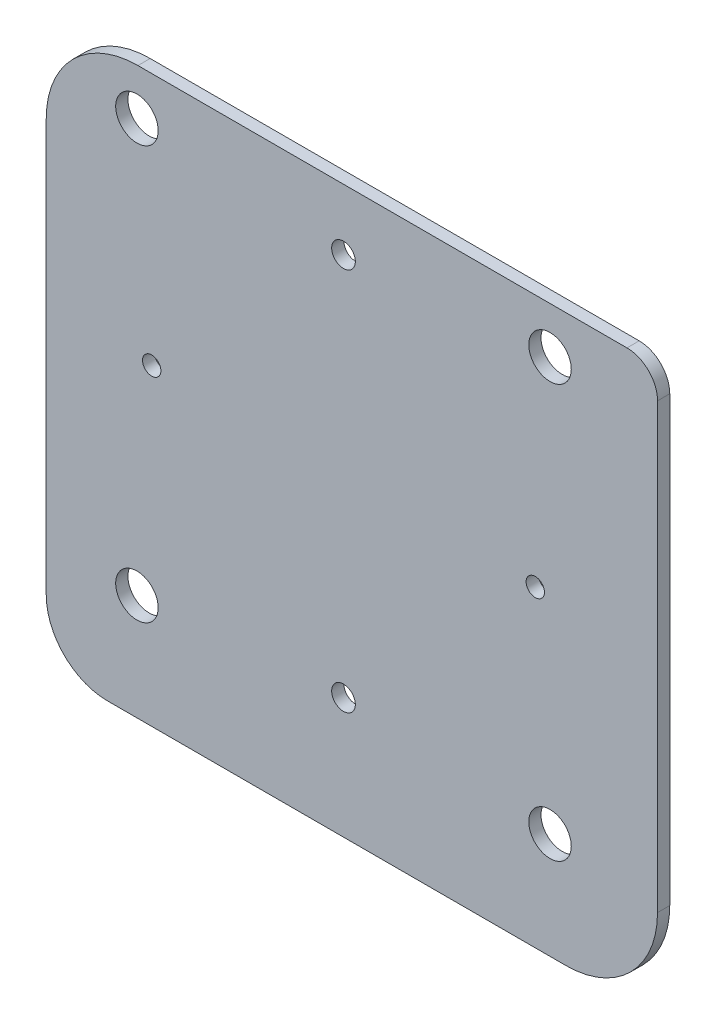
ISO-10303-21;
HEADER;
FILE_DESCRIPTION(('STEP AP214'),'2;1');
FILE_NAME('part.step','',(''),(''),'','','');
FILE_SCHEMA(('AUTOMOTIVE_DESIGN { 1 0 10303 214 1 1 1 1 }'));
ENDSEC;
DATA;
#1=APPLICATION_CONTEXT('core data for automotive mechanical design processes');
#2=APPLICATION_PROTOCOL_DEFINITION('international standard','automotive_design',2000,#1);
#3=PRODUCT_CONTEXT('',#1,'mechanical');
#4=PRODUCT('Part','Part','',(#3));
#5=PRODUCT_RELATED_PRODUCT_CATEGORY('part','',(#4));
#6=PRODUCT_DEFINITION_FORMATION('','',#4);
#7=PRODUCT_DEFINITION_CONTEXT('part definition',#1,'design');
#8=PRODUCT_DEFINITION('design','',#6,#7);
#9=PRODUCT_DEFINITION_SHAPE('','',#8);
#10=(LENGTH_UNIT() NAMED_UNIT(*) SI_UNIT(.MILLI.,.METRE.));
#11=(NAMED_UNIT(*) PLANE_ANGLE_UNIT() SI_UNIT($,.RADIAN.));
#12=(NAMED_UNIT(*) SI_UNIT($,.STERADIAN.) SOLID_ANGLE_UNIT());
#13=UNCERTAINTY_MEASURE_WITH_UNIT(LENGTH_MEASURE(1.E-05),#10,'distance_accuracy_value','');
#14=(GEOMETRIC_REPRESENTATION_CONTEXT(3) GLOBAL_UNCERTAINTY_ASSIGNED_CONTEXT((#13)) GLOBAL_UNIT_ASSIGNED_CONTEXT((#10,
#11,#12)) REPRESENTATION_CONTEXT('',''));
#15=CARTESIAN_POINT('',(0.,0.,0.));
#16=DIRECTION('',(0.,0.,1.));
#17=DIRECTION('',(1.,0.,0.));
#18=AXIS2_PLACEMENT_3D('',#15,#16,#17);
#19=CARTESIAN_POINT('',(-26.9000000000002,21.1,1.6));
#20=DIRECTION('',(0.,0.,-1.));
#21=DIRECTION('',(-1.,0.,0.));
#22=AXIS2_PLACEMENT_3D('',#19,#20,#21);
#23=CYLINDRICAL_SURFACE('',#22,12.);
#24=CARTESIAN_POINT('',(-26.9000000000002,21.1,0.));
#25=DIRECTION('',(0.,0.,1.));
#26=DIRECTION('',(-1.,0.,0.));
#27=AXIS2_PLACEMENT_3D('',#24,#25,#26);
#28=CIRCLE('',#27,12.);
#29=CARTESIAN_POINT('',(-26.9000000000002,33.1,0.));
#30=VERTEX_POINT('',#29);
#31=CARTESIAN_POINT('',(-38.9000000000002,21.0999999999999,0.));
#32=VERTEX_POINT('',#31);
#33=EDGE_CURVE('E130',#30,#32,#28,.T.);
#34=ORIENTED_EDGE('',*,*,#33,.T.);
#35=DIRECTION('',(0.,0.,-1.));
#36=VECTOR('',#35,1.);
#37=CARTESIAN_POINT('',(-38.9000000000002,21.0999999999999,1.6));
#38=LINE('',#37,#36);
#39=CARTESIAN_POINT('',(-38.9000000000002,21.0999999999999,1.6));
#40=VERTEX_POINT('',#39);
#41=EDGE_CURVE('E11',#40,#32,#38,.T.);
#42=ORIENTED_EDGE('',*,*,#41,.F.);
#43=CARTESIAN_POINT('',(-26.9000000000002,21.1,1.6));
#44=DIRECTION('',(0.,0.,1.));
#45=DIRECTION('',(-1.,0.,0.));
#46=AXIS2_PLACEMENT_3D('',#43,#44,#45);
#47=CIRCLE('',#46,12.);
#48=CARTESIAN_POINT('',(-26.9000000000002,33.1,1.6));
#49=VERTEX_POINT('',#48);
#50=EDGE_CURVE('E145',#49,#40,#47,.T.);
#51=ORIENTED_EDGE('',*,*,#50,.F.);
#52=DIRECTION('',(0.,0.,-1.));
#53=VECTOR('',#52,1.);
#54=CARTESIAN_POINT('',(-26.9000000000002,33.1,1.6));
#55=LINE('',#54,#53);
#56=EDGE_CURVE('E126',#49,#30,#55,.T.);
#57=ORIENTED_EDGE('',*,*,#56,.T.);
#58=EDGE_LOOP('',(#34,#42,#51,#57));
#59=FACE_BOUND('',#58,.T.);
#60=ADVANCED_FACE('F34',(#59),#23,.T.);
#61=CARTESIAN_POINT('',(-38.9000000000002,21.0999999999999,1.6));
#62=DIRECTION('',(1.,0.,0.));
#63=DIRECTION('',(0.,1.,0.));
#64=AXIS2_PLACEMENT_3D('',#61,#62,#63);
#65=PLANE('',#64);
#66=DIRECTION('',(0.,-1.,0.));
#67=VECTOR('',#66,1.);
#68=CARTESIAN_POINT('',(-38.9000000000002,21.0999999999999,0.));
#69=LINE('',#68,#67);
#70=CARTESIAN_POINT('',(-38.8999999999997,-32.9000000000001,0.));
#71=VERTEX_POINT('',#70);
#72=EDGE_CURVE('E133',#32,#71,#69,.T.);
#73=ORIENTED_EDGE('',*,*,#72,.T.);
#74=DIRECTION('',(0.,0.,-1.));
#75=VECTOR('',#74,1.);
#76=CARTESIAN_POINT('',(-38.8999999999997,-32.9000000000001,1.6));
#77=LINE('',#76,#75);
#78=CARTESIAN_POINT('',(-38.8999999999997,-32.9000000000001,1.6));
#79=VERTEX_POINT('',#78);
#80=EDGE_CURVE('E42',#79,#71,#77,.T.);
#81=ORIENTED_EDGE('',*,*,#80,.F.);
#82=DIRECTION('',(0.,-1.,0.));
#83=VECTOR('',#82,1.);
#84=CARTESIAN_POINT('',(-38.9000000000002,21.0999999999999,1.6));
#85=LINE('',#84,#83);
#86=EDGE_CURVE('E93',#40,#79,#85,.T.);
#87=ORIENTED_EDGE('',*,*,#86,.F.);
#88=ORIENTED_EDGE('',*,*,#41,.T.);
#89=EDGE_LOOP('',(#73,#81,#87,#88));
#90=FACE_BOUND('',#89,.T.);
#91=ADVANCED_FACE('F259',(#90),#65,.F.);
#92=CARTESIAN_POINT('',(-30.8999999999997,-32.9,1.6));
#93=DIRECTION('',(0.,0.,-1.));
#94=DIRECTION('',(-1.,0.,0.));
#95=AXIS2_PLACEMENT_3D('',#92,#93,#94);
#96=CYLINDRICAL_SURFACE('',#95,8.);
#97=CARTESIAN_POINT('',(-30.8999999999997,-32.9,0.));
#98=DIRECTION('',(0.,0.,1.));
#99=DIRECTION('',(1.,0.,0.));
#100=AXIS2_PLACEMENT_3D('',#97,#98,#99);
#101=CIRCLE('',#100,8.);
#102=CARTESIAN_POINT('',(-30.8999999999997,-40.9,0.));
#103=VERTEX_POINT('',#102);
#104=EDGE_CURVE('E136',#71,#103,#101,.T.);
#105=ORIENTED_EDGE('',*,*,#104,.T.);
#106=DIRECTION('',(0.,0.,-1.));
#107=VECTOR('',#106,1.);
#108=CARTESIAN_POINT('',(-30.8999999999997,-40.9,1.6));
#109=LINE('',#108,#107);
#110=CARTESIAN_POINT('',(-30.8999999999997,-40.9,1.6));
#111=VERTEX_POINT('',#110);
#112=EDGE_CURVE('E152',#111,#103,#109,.T.);
#113=ORIENTED_EDGE('',*,*,#112,.F.);
#114=CARTESIAN_POINT('',(-30.8999999999997,-32.9,1.6));
#115=DIRECTION('',(0.,0.,1.));
#116=DIRECTION('',(1.,0.,0.));
#117=AXIS2_PLACEMENT_3D('',#114,#115,#116);
#118=CIRCLE('',#117,8.);
#119=EDGE_CURVE('E160',#79,#111,#118,.T.);
#120=ORIENTED_EDGE('',*,*,#119,.F.);
#121=ORIENTED_EDGE('',*,*,#80,.T.);
#122=EDGE_LOOP('',(#105,#113,#120,#121));
#123=FACE_BOUND('',#122,.T.);
#124=ADVANCED_FACE('F158',(#123),#96,.T.);
#125=CARTESIAN_POINT('',(-30.8999999999997,-40.9,1.6));
#126=DIRECTION('',(0.,1.,0.));
#127=DIRECTION('',(-1.,0.,0.));
#128=AXIS2_PLACEMENT_3D('',#125,#126,#127);
#129=PLANE('',#128);
#130=DIRECTION('',(1.,0.,0.));
#131=VECTOR('',#130,1.);
#132=CARTESIAN_POINT('',(-30.8999999999997,-40.9,0.));
#133=LINE('',#132,#131);
#134=CARTESIAN_POINT('',(29.1000000000003,-40.9,0.));
#135=VERTEX_POINT('',#134);
#136=EDGE_CURVE('E138',#103,#135,#133,.T.);
#137=ORIENTED_EDGE('',*,*,#136,.T.);
#138=DIRECTION('',(0.,0.,-1.));
#139=VECTOR('',#138,1.);
#140=CARTESIAN_POINT('',(29.1000000000003,-40.9,1.6));
#141=LINE('',#140,#139);
#142=CARTESIAN_POINT('',(29.1000000000003,-40.9,1.6));
#143=VERTEX_POINT('',#142);
#144=EDGE_CURVE('E149',#143,#135,#141,.T.);
#145=ORIENTED_EDGE('',*,*,#144,.F.);
#146=DIRECTION('',(1.,0.,0.));
#147=VECTOR('',#146,1.);
#148=CARTESIAN_POINT('',(-30.8999999999997,-40.9,1.6));
#149=LINE('',#148,#147);
#150=EDGE_CURVE('E172',#111,#143,#149,.T.);
#151=ORIENTED_EDGE('',*,*,#150,.F.);
#152=ORIENTED_EDGE('',*,*,#112,.T.);
#153=EDGE_LOOP('',(#137,#145,#151,#152));
#154=FACE_BOUND('',#153,.T.);
#155=ADVANCED_FACE('F168',(#154),#129,.F.);
#156=CARTESIAN_POINT('',(29.1000000000003,-28.9,1.6));
#157=DIRECTION('',(0.,0.,-1.));
#158=DIRECTION('',(-1.,0.,0.));
#159=AXIS2_PLACEMENT_3D('',#156,#157,#158);
#160=CYLINDRICAL_SURFACE('',#159,12.);
#161=CARTESIAN_POINT('',(29.1000000000003,-28.9,0.));
#162=DIRECTION('',(0.,0.,1.));
#163=DIRECTION('',(-1.,0.,0.));
#164=AXIS2_PLACEMENT_3D('',#161,#162,#163);
#165=CIRCLE('',#164,12.);
#166=CARTESIAN_POINT('',(41.1000000000003,-28.9,0.));
#167=VERTEX_POINT('',#166);
#168=EDGE_CURVE('E140',#135,#167,#165,.T.);
#169=ORIENTED_EDGE('',*,*,#168,.T.);
#170=DIRECTION('',(0.,0.,-1.));
#171=VECTOR('',#170,1.);
#172=CARTESIAN_POINT('',(41.1000000000003,-28.9,1.6));
#173=LINE('',#172,#171);
#174=CARTESIAN_POINT('',(41.1000000000003,-28.9,1.6));
#175=VERTEX_POINT('',#174);
#176=EDGE_CURVE('E121',#175,#167,#173,.T.);
#177=ORIENTED_EDGE('',*,*,#176,.F.);
#178=CARTESIAN_POINT('',(29.1000000000003,-28.9,1.6));
#179=DIRECTION('',(0.,0.,1.));
#180=DIRECTION('',(-1.,0.,0.));
#181=AXIS2_PLACEMENT_3D('',#178,#179,#180);
#182=CIRCLE('',#181,12.);
#183=EDGE_CURVE('E112',#143,#175,#182,.T.);
#184=ORIENTED_EDGE('',*,*,#183,.F.);
#185=ORIENTED_EDGE('',*,*,#144,.T.);
#186=EDGE_LOOP('',(#169,#177,#184,#185));
#187=FACE_BOUND('',#186,.T.);
#188=ADVANCED_FACE('F171',(#187),#160,.T.);
#189=CARTESIAN_POINT('',(41.1000000000003,-28.9,1.6));
#190=DIRECTION('',(-1.,0.,0.));
#191=DIRECTION('',(0.,0.,1.));
#192=AXIS2_PLACEMENT_3D('',#189,#190,#191);
#193=PLANE('',#192);
#194=DIRECTION('',(0.,1.,0.));
#195=VECTOR('',#194,1.);
#196=CARTESIAN_POINT('',(41.1000000000003,-28.9,0.));
#197=LINE('',#196,#195);
#198=CARTESIAN_POINT('',(41.1000000000003,29.1000000000001,0.));
#199=VERTEX_POINT('',#198);
#200=EDGE_CURVE('E120',#167,#199,#197,.T.);
#201=ORIENTED_EDGE('',*,*,#200,.T.);
#202=DIRECTION('',(0.,0.,-1.));
#203=VECTOR('',#202,1.);
#204=CARTESIAN_POINT('',(41.1000000000003,29.1000000000001,1.6));
#205=LINE('',#204,#203);
#206=CARTESIAN_POINT('',(41.1000000000003,29.1000000000001,1.6));
#207=VERTEX_POINT('',#206);
#208=EDGE_CURVE('E117',#207,#199,#205,.T.);
#209=ORIENTED_EDGE('',*,*,#208,.F.);
#210=DIRECTION('',(0.,1.,0.));
#211=VECTOR('',#210,1.);
#212=CARTESIAN_POINT('',(41.1000000000003,-28.9,1.6));
#213=LINE('',#212,#211);
#214=EDGE_CURVE('E106',#175,#207,#213,.T.);
#215=ORIENTED_EDGE('',*,*,#214,.F.);
#216=ORIENTED_EDGE('',*,*,#176,.T.);
#217=EDGE_LOOP('',(#201,#209,#215,#216));
#218=FACE_BOUND('',#217,.T.);
#219=ADVANCED_FACE('F118',(#218),#193,.F.);
#220=CARTESIAN_POINT('',(37.1000000000003,29.1,1.6));
#221=DIRECTION('',(0.,0.,-1.));
#222=DIRECTION('',(-1.,0.,0.));
#223=AXIS2_PLACEMENT_3D('',#220,#221,#222);
#224=CYLINDRICAL_SURFACE('',#223,4.);
#225=CARTESIAN_POINT('',(37.1000000000003,29.1,0.));
#226=DIRECTION('',(0.,0.,1.));
#227=DIRECTION('',(1.,0.,0.));
#228=AXIS2_PLACEMENT_3D('',#225,#226,#227);
#229=CIRCLE('',#228,4.);
#230=CARTESIAN_POINT('',(37.0999999999998,33.1,0.));
#231=VERTEX_POINT('',#230);
#232=EDGE_CURVE('E79',#199,#231,#229,.T.);
#233=ORIENTED_EDGE('',*,*,#232,.T.);
#234=DIRECTION('',(0.,0.,-1.));
#235=VECTOR('',#234,1.);
#236=CARTESIAN_POINT('',(37.0999999999998,33.1,1.6));
#237=LINE('',#236,#235);
#238=CARTESIAN_POINT('',(37.0999999999998,33.1,1.6));
#239=VERTEX_POINT('',#238);
#240=EDGE_CURVE('E122',#239,#231,#237,.T.);
#241=ORIENTED_EDGE('',*,*,#240,.F.);
#242=CARTESIAN_POINT('',(37.1000000000003,29.1,1.6));
#243=DIRECTION('',(0.,0.,1.));
#244=DIRECTION('',(1.,0.,0.));
#245=AXIS2_PLACEMENT_3D('',#242,#243,#244);
#246=CIRCLE('',#245,4.);
#247=EDGE_CURVE('E110',#207,#239,#246,.T.);
#248=ORIENTED_EDGE('',*,*,#247,.F.);
#249=ORIENTED_EDGE('',*,*,#208,.T.);
#250=EDGE_LOOP('',(#233,#241,#248,#249));
#251=FACE_BOUND('',#250,.T.);
#252=ADVANCED_FACE('F124',(#251),#224,.T.);
#253=CARTESIAN_POINT('',(-26.9000000000002,33.1,1.6));
#254=DIRECTION('',(0.,-1.,0.));
#255=DIRECTION('',(1.,0.,0.));
#256=AXIS2_PLACEMENT_3D('',#253,#254,#255);
#257=PLANE('',#256);
#258=DIRECTION('',(-1.,0.,0.));
#259=VECTOR('',#258,1.);
#260=CARTESIAN_POINT('',(-26.9000000000002,33.1,0.));
#261=LINE('',#260,#259);
#262=EDGE_CURVE('E85',#231,#30,#261,.T.);
#263=ORIENTED_EDGE('',*,*,#262,.T.);
#264=ORIENTED_EDGE('',*,*,#56,.F.);
#265=DIRECTION('',(-1.,0.,0.));
#266=VECTOR('',#265,1.);
#267=CARTESIAN_POINT('',(-26.9000000000002,33.1,1.6));
#268=LINE('',#267,#266);
#269=EDGE_CURVE('E50',#239,#49,#268,.T.);
#270=ORIENTED_EDGE('',*,*,#269,.F.);
#271=ORIENTED_EDGE('',*,*,#240,.T.);
#272=EDGE_LOOP('',(#263,#264,#270,#271));
#273=FACE_BOUND('',#272,.T.);
#274=ADVANCED_FACE('F230',(#273),#257,.F.);
#275=CARTESIAN_POINT('',(-26.9000000000002,21.1,1.6));
#276=DIRECTION('',(0.,0.,-1.));
#277=DIRECTION('',(-1.,0.,0.));
#278=AXIS2_PLACEMENT_3D('',#275,#276,#277);
#279=PLANE('',#278);
#280=CARTESIAN_POINT('',(27.0307333360464,27.0307333360452,1.6));
#281=DIRECTION('',(0.,0.,1.));
#282=DIRECTION('',(1.,0.,0.));
#283=AXIS2_PLACEMENT_3D('',#280,#281,#282);
#284=CIRCLE('',#283,2.78);
#285=CARTESIAN_POINT('',(29.8107333360464,27.0307333360452,1.6));
#286=VERTEX_POINT('',#285);
#287=EDGE_CURVE('E205',#286,#286,#284,.T.);
#288=ORIENTED_EDGE('',*,*,#287,.F.);
#289=EDGE_LOOP('',(#288));
#290=FACE_BOUND('',#289,.T.);
#291=CARTESIAN_POINT('',(-27.0307333360462,-27.0307333360454,1.6));
#292=DIRECTION('',(0.,0.,1.));
#293=DIRECTION('',(1.,0.,0.));
#294=AXIS2_PLACEMENT_3D('',#291,#292,#293);
#295=CIRCLE('',#294,2.78);
#296=CARTESIAN_POINT('',(-24.2507333360462,-27.0307333360454,1.6));
#297=VERTEX_POINT('',#296);
#298=EDGE_CURVE('E211',#297,#297,#295,.T.);
#299=ORIENTED_EDGE('',*,*,#298,.F.);
#300=EDGE_LOOP('',(#299));
#301=FACE_BOUND('',#300,.T.);
#302=CARTESIAN_POINT('',(27.0307333360455,-27.0307333360461,1.6));
#303=DIRECTION('',(0.,0.,1.));
#304=DIRECTION('',(1.,0.,0.));
#305=AXIS2_PLACEMENT_3D('',#302,#303,#304);
#306=CIRCLE('',#305,2.78);
#307=CARTESIAN_POINT('',(29.8107333360455,-27.0307333360461,1.6));
#308=VERTEX_POINT('',#307);
#309=EDGE_CURVE('E212',#308,#308,#306,.T.);
#310=ORIENTED_EDGE('',*,*,#309,.F.);
#311=EDGE_LOOP('',(#310));
#312=FACE_BOUND('',#311,.T.);
#313=CARTESIAN_POINT('',(-27.0307333360453,27.0307333360463,1.6));
#314=DIRECTION('',(0.,0.,1.));
#315=DIRECTION('',(1.,0.,0.));
#316=AXIS2_PLACEMENT_3D('',#313,#314,#315);
#317=CIRCLE('',#316,2.78);
#318=CARTESIAN_POINT('',(-24.2507333360453,27.0307333360463,1.6));
#319=VERTEX_POINT('',#318);
#320=EDGE_CURVE('E182',#319,#319,#317,.T.);
#321=ORIENTED_EDGE('',*,*,#320,.F.);
#322=EDGE_LOOP('',(#321));
#323=FACE_BOUND('',#322,.T.);
#324=CARTESIAN_POINT('',(-6.67661181896761E-06,25.0999914458268,1.6));
#325=DIRECTION('',(0.,0.,1.));
#326=DIRECTION('',(1.,0.,0.));
#327=AXIS2_PLACEMENT_3D('',#324,#325,#326);
#328=CIRCLE('',#327,1.55);
#329=CARTESIAN_POINT('',(1.54999332338818,25.0999914458268,1.6));
#330=VERTEX_POINT('',#329);
#331=EDGE_CURVE('E134',#330,#330,#328,.T.);
#332=ORIENTED_EDGE('',*,*,#331,.F.);
#333=EDGE_LOOP('',(#332));
#334=FACE_BOUND('',#333,.T.);
#335=CARTESIAN_POINT('',(25.0999933233883,-8.55417322392915E-06,1.6));
#336=DIRECTION('',(0.,0.,1.));
#337=DIRECTION('',(1.,0.,0.));
#338=AXIS2_PLACEMENT_3D('',#335,#336,#337);
#339=CIRCLE('',#338,1.19999999999999);
#340=CARTESIAN_POINT('',(26.2999933233883,-8.55417322392915E-06,1.6));
#341=VERTEX_POINT('',#340);
#342=EDGE_CURVE('E194',#341,#341,#339,.T.);
#343=ORIENTED_EDGE('',*,*,#342,.F.);
#344=EDGE_LOOP('',(#343));
#345=FACE_BOUND('',#344,.T.);
#346=CARTESIAN_POINT('',(-6.67661187447877E-06,-25.1000085541733,1.6));
#347=DIRECTION('',(0.,0.,1.));
#348=DIRECTION('',(1.,0.,0.));
#349=AXIS2_PLACEMENT_3D('',#346,#347,#348);
#350=CIRCLE('',#349,1.55);
#351=CARTESIAN_POINT('',(1.54999332338812,-25.1000085541733,1.6));
#352=VERTEX_POINT('',#351);
#353=EDGE_CURVE('E188',#352,#352,#350,.T.);
#354=ORIENTED_EDGE('',*,*,#353,.F.);
#355=EDGE_LOOP('',(#354));
#356=FACE_BOUND('',#355,.T.);
#357=CARTESIAN_POINT('',(-25.1000066766119,-8.55417322392915E-06,1.6));
#358=DIRECTION('',(0.,0.,1.));
#359=DIRECTION('',(1.,0.,0.));
#360=AXIS2_PLACEMENT_3D('',#357,#358,#359);
#361=CIRCLE('',#360,1.2);
#362=CARTESIAN_POINT('',(-23.9000066766119,-8.55417322392915E-06,1.6));
#363=VERTEX_POINT('',#362);
#364=EDGE_CURVE('E181',#363,#363,#361,.T.);
#365=ORIENTED_EDGE('',*,*,#364,.F.);
#366=EDGE_LOOP('',(#365));
#367=FACE_BOUND('',#366,.T.);
#368=ORIENTED_EDGE('',*,*,#50,.T.);
#369=ORIENTED_EDGE('',*,*,#86,.T.);
#370=ORIENTED_EDGE('',*,*,#119,.T.);
#371=ORIENTED_EDGE('',*,*,#150,.T.);
#372=ORIENTED_EDGE('',*,*,#183,.T.);
#373=ORIENTED_EDGE('',*,*,#214,.T.);
#374=ORIENTED_EDGE('',*,*,#247,.T.);
#375=ORIENTED_EDGE('',*,*,#269,.T.);
#376=EDGE_LOOP('',(#368,#369,#370,#371,#372,#373,#374,#375));
#377=FACE_BOUND('',#376,.T.);
#378=ADVANCED_FACE('F108',(#290,#301,#312,#323,#334,#345,#356,#367,#377),#279,.F.);
#379=CARTESIAN_POINT('',(-26.9000000000002,21.1,0.));
#380=DIRECTION('',(0.,0.,-1.));
#381=DIRECTION('',(-1.,0.,0.));
#382=AXIS2_PLACEMENT_3D('',#379,#380,#381);
#383=PLANE('',#382);
#384=CARTESIAN_POINT('',(27.0307333360464,27.0307333360452,0.));
#385=DIRECTION('',(0.,0.,-1.));
#386=DIRECTION('',(-1.,0.,0.));
#387=AXIS2_PLACEMENT_3D('',#384,#385,#386);
#388=CIRCLE('',#387,2.78);
#389=CARTESIAN_POINT('',(24.2507333360464,27.0307333360452,0.));
#390=VERTEX_POINT('',#389);
#391=EDGE_CURVE('E215',#390,#390,#388,.F.);
#392=ORIENTED_EDGE('',*,*,#391,.T.);
#393=EDGE_LOOP('',(#392));
#394=FACE_BOUND('',#393,.T.);
#395=CARTESIAN_POINT('',(-27.0307333360462,-27.0307333360454,0.));
#396=DIRECTION('',(0.,0.,-1.));
#397=DIRECTION('',(-1.,0.,0.));
#398=AXIS2_PLACEMENT_3D('',#395,#396,#397);
#399=CIRCLE('',#398,2.78);
#400=CARTESIAN_POINT('',(-29.8107333360462,-27.0307333360454,0.));
#401=VERTEX_POINT('',#400);
#402=EDGE_CURVE('E208',#401,#401,#399,.F.);
#403=ORIENTED_EDGE('',*,*,#402,.T.);
#404=EDGE_LOOP('',(#403));
#405=FACE_BOUND('',#404,.T.);
#406=CARTESIAN_POINT('',(27.0307333360455,-27.0307333360461,0.));
#407=DIRECTION('',(0.,0.,-1.));
#408=DIRECTION('',(-1.,0.,0.));
#409=AXIS2_PLACEMENT_3D('',#406,#407,#408);
#410=CIRCLE('',#409,2.78);
#411=CARTESIAN_POINT('',(24.2507333360455,-27.0307333360461,0.));
#412=VERTEX_POINT('',#411);
#413=EDGE_CURVE('E220',#412,#412,#410,.F.);
#414=ORIENTED_EDGE('',*,*,#413,.T.);
#415=EDGE_LOOP('',(#414));
#416=FACE_BOUND('',#415,.T.);
#417=CARTESIAN_POINT('',(-27.0307333360453,27.0307333360463,0.));
#418=DIRECTION('',(0.,0.,-1.));
#419=DIRECTION('',(-1.,0.,0.));
#420=AXIS2_PLACEMENT_3D('',#417,#418,#419);
#421=CIRCLE('',#420,2.78);
#422=CARTESIAN_POINT('',(-29.8107333360453,27.0307333360463,0.));
#423=VERTEX_POINT('',#422);
#424=EDGE_CURVE('E202',#423,#423,#421,.F.);
#425=ORIENTED_EDGE('',*,*,#424,.T.);
#426=EDGE_LOOP('',(#425));
#427=FACE_BOUND('',#426,.T.);
#428=CARTESIAN_POINT('',(-6.67661181896761E-06,25.0999914458268,0.));
#429=DIRECTION('',(0.,0.,-1.));
#430=DIRECTION('',(-1.,0.,0.));
#431=AXIS2_PLACEMENT_3D('',#428,#429,#430);
#432=CIRCLE('',#431,1.55);
#433=CARTESIAN_POINT('',(-1.55000667661182,25.0999914458268,0.));
#434=VERTEX_POINT('',#433);
#435=EDGE_CURVE('E197',#434,#434,#432,.F.);
#436=ORIENTED_EDGE('',*,*,#435,.T.);
#437=EDGE_LOOP('',(#436));
#438=FACE_BOUND('',#437,.T.);
#439=CARTESIAN_POINT('',(25.0999933233883,-8.55417322392915E-06,0.));
#440=DIRECTION('',(0.,0.,-1.));
#441=DIRECTION('',(-1.,0.,0.));
#442=AXIS2_PLACEMENT_3D('',#439,#440,#441);
#443=CIRCLE('',#442,1.19999999999999);
#444=CARTESIAN_POINT('',(23.8999933233883,-8.55417322392915E-06,0.));
#445=VERTEX_POINT('',#444);
#446=EDGE_CURVE('E191',#445,#445,#443,.F.);
#447=ORIENTED_EDGE('',*,*,#446,.T.);
#448=EDGE_LOOP('',(#447));
#449=FACE_BOUND('',#448,.T.);
#450=CARTESIAN_POINT('',(-6.67661187447877E-06,-25.1000085541733,0.));
#451=DIRECTION('',(0.,0.,-1.));
#452=DIRECTION('',(-1.,0.,0.));
#453=AXIS2_PLACEMENT_3D('',#450,#451,#452);
#454=CIRCLE('',#453,1.55);
#455=CARTESIAN_POINT('',(-1.55000667661187,-25.1000085541733,0.));
#456=VERTEX_POINT('',#455);
#457=EDGE_CURVE('E185',#456,#456,#454,.F.);
#458=ORIENTED_EDGE('',*,*,#457,.T.);
#459=EDGE_LOOP('',(#458));
#460=FACE_BOUND('',#459,.T.);
#461=CARTESIAN_POINT('',(-25.1000066766119,-8.55417322392915E-06,0.));
#462=DIRECTION('',(0.,0.,-1.));
#463=DIRECTION('',(-1.,0.,0.));
#464=AXIS2_PLACEMENT_3D('',#461,#462,#463);
#465=CIRCLE('',#464,1.2);
#466=CARTESIAN_POINT('',(-26.3000066766119,-8.55417322392915E-06,0.));
#467=VERTEX_POINT('',#466);
#468=EDGE_CURVE('E178',#467,#467,#465,.F.);
#469=ORIENTED_EDGE('',*,*,#468,.T.);
#470=EDGE_LOOP('',(#469));
#471=FACE_BOUND('',#470,.T.);
#472=ORIENTED_EDGE('',*,*,#33,.F.);
#473=ORIENTED_EDGE('',*,*,#262,.F.);
#474=ORIENTED_EDGE('',*,*,#232,.F.);
#475=ORIENTED_EDGE('',*,*,#200,.F.);
#476=ORIENTED_EDGE('',*,*,#168,.F.);
#477=ORIENTED_EDGE('',*,*,#136,.F.);
#478=ORIENTED_EDGE('',*,*,#104,.F.);
#479=ORIENTED_EDGE('',*,*,#72,.F.);
#480=EDGE_LOOP('',(#472,#473,#474,#475,#476,#477,#478,#479));
#481=FACE_BOUND('',#480,.T.);
#482=ADVANCED_FACE('F164',(#394,#405,#416,#427,#438,#449,#460,#471,#481),#383,.T.);
#483=CARTESIAN_POINT('',(-25.1000066766119,-8.55417322392915E-06,-0.000999999999999916));
#484=DIRECTION('',(0.,0.,1.));
#485=DIRECTION('',(1.,0.,0.));
#486=AXIS2_PLACEMENT_3D('',#483,#484,#485);
#487=CYLINDRICAL_SURFACE('',#486,1.2);
#488=ORIENTED_EDGE('',*,*,#468,.F.);
#489=EDGE_LOOP('',(#488));
#490=FACE_BOUND('',#489,.T.);
#491=ORIENTED_EDGE('',*,*,#364,.T.);
#492=EDGE_LOOP('',(#491));
#493=FACE_BOUND('',#492,.T.);
#494=ADVANCED_FACE('F243',(#490,#493),#487,.F.);
#495=CARTESIAN_POINT('',(-6.67661187447877E-06,-25.1000085541733,-0.000999999999999916));
#496=DIRECTION('',(0.,0.,1.));
#497=DIRECTION('',(1.,0.,0.));
#498=AXIS2_PLACEMENT_3D('',#495,#496,#497);
#499=CYLINDRICAL_SURFACE('',#498,1.55);
#500=ORIENTED_EDGE('',*,*,#457,.F.);
#501=EDGE_LOOP('',(#500));
#502=FACE_BOUND('',#501,.T.);
#503=ORIENTED_EDGE('',*,*,#353,.T.);
#504=EDGE_LOOP('',(#503));
#505=FACE_BOUND('',#504,.T.);
#506=ADVANCED_FACE('F245',(#502,#505),#499,.F.);
#507=CARTESIAN_POINT('',(25.0999933233883,-8.55417322392915E-06,-0.000999999999999916));
#508=DIRECTION('',(0.,0.,1.));
#509=DIRECTION('',(1.,0.,0.));
#510=AXIS2_PLACEMENT_3D('',#507,#508,#509);
#511=CYLINDRICAL_SURFACE('',#510,1.19999999999999);
#512=ORIENTED_EDGE('',*,*,#446,.F.);
#513=EDGE_LOOP('',(#512));
#514=FACE_BOUND('',#513,.T.);
#515=ORIENTED_EDGE('',*,*,#342,.T.);
#516=EDGE_LOOP('',(#515));
#517=FACE_BOUND('',#516,.T.);
#518=ADVANCED_FACE('F252',(#514,#517),#511,.F.);
#519=CARTESIAN_POINT('',(-6.67661181896761E-06,25.0999914458268,-0.000999999999999916));
#520=DIRECTION('',(0.,0.,1.));
#521=DIRECTION('',(1.,0.,0.));
#522=AXIS2_PLACEMENT_3D('',#519,#520,#521);
#523=CYLINDRICAL_SURFACE('',#522,1.55);
#524=ORIENTED_EDGE('',*,*,#435,.F.);
#525=EDGE_LOOP('',(#524));
#526=FACE_BOUND('',#525,.T.);
#527=ORIENTED_EDGE('',*,*,#331,.T.);
#528=EDGE_LOOP('',(#527));
#529=FACE_BOUND('',#528,.T.);
#530=ADVANCED_FACE('F325',(#526,#529),#523,.F.);
#531=CARTESIAN_POINT('',(-27.0307333360453,27.0307333360463,-0.000999999999999916));
#532=DIRECTION('',(0.,0.,1.));
#533=DIRECTION('',(1.,0.,0.));
#534=AXIS2_PLACEMENT_3D('',#531,#532,#533);
#535=CYLINDRICAL_SURFACE('',#534,2.78);
#536=ORIENTED_EDGE('',*,*,#424,.F.);
#537=EDGE_LOOP('',(#536));
#538=FACE_BOUND('',#537,.T.);
#539=ORIENTED_EDGE('',*,*,#320,.T.);
#540=EDGE_LOOP('',(#539));
#541=FACE_BOUND('',#540,.T.);
#542=ADVANCED_FACE('F335',(#538,#541),#535,.F.);
#543=CARTESIAN_POINT('',(27.0307333360455,-27.0307333360461,-0.000999999999999916));
#544=DIRECTION('',(0.,0.,1.));
#545=DIRECTION('',(1.,0.,0.));
#546=AXIS2_PLACEMENT_3D('',#543,#544,#545);
#547=CYLINDRICAL_SURFACE('',#546,2.78);
#548=ORIENTED_EDGE('',*,*,#413,.F.);
#549=EDGE_LOOP('',(#548));
#550=FACE_BOUND('',#549,.T.);
#551=ORIENTED_EDGE('',*,*,#309,.T.);
#552=EDGE_LOOP('',(#551));
#553=FACE_BOUND('',#552,.T.);
#554=ADVANCED_FACE('F226',(#550,#553),#547,.F.);
#555=CARTESIAN_POINT('',(-27.0307333360462,-27.0307333360454,-0.000999999999999916));
#556=DIRECTION('',(0.,0.,1.));
#557=DIRECTION('',(1.,0.,0.));
#558=AXIS2_PLACEMENT_3D('',#555,#556,#557);
#559=CYLINDRICAL_SURFACE('',#558,2.78);
#560=ORIENTED_EDGE('',*,*,#402,.F.);
#561=EDGE_LOOP('',(#560));
#562=FACE_BOUND('',#561,.T.);
#563=ORIENTED_EDGE('',*,*,#298,.T.);
#564=EDGE_LOOP('',(#563));
#565=FACE_BOUND('',#564,.T.);
#566=ADVANCED_FACE('F364',(#562,#565),#559,.F.);
#567=CARTESIAN_POINT('',(27.0307333360464,27.0307333360452,-0.000999999999999916));
#568=DIRECTION('',(0.,0.,1.));
#569=DIRECTION('',(1.,0.,0.));
#570=AXIS2_PLACEMENT_3D('',#567,#568,#569);
#571=CYLINDRICAL_SURFACE('',#570,2.78);
#572=ORIENTED_EDGE('',*,*,#391,.F.);
#573=EDGE_LOOP('',(#572));
#574=FACE_BOUND('',#573,.T.);
#575=ORIENTED_EDGE('',*,*,#287,.T.);
#576=EDGE_LOOP('',(#575));
#577=FACE_BOUND('',#576,.T.);
#578=ADVANCED_FACE('F374',(#574,#577),#571,.F.);
#579=CLOSED_SHELL('',(#60,#91,#124,#155,#188,#219,#252,#274,#378,#482,#494,#506,#518,#530,#542,
#554,#566,#578));
#580=MANIFOLD_SOLID_BREP('B2',#579);
#581=ADVANCED_BREP_SHAPE_REPRESENTATION('',(#18,#580),#14);
#582=SHAPE_DEFINITION_REPRESENTATION(#9,#581);
ENDSEC;
END-ISO-10303-21;
